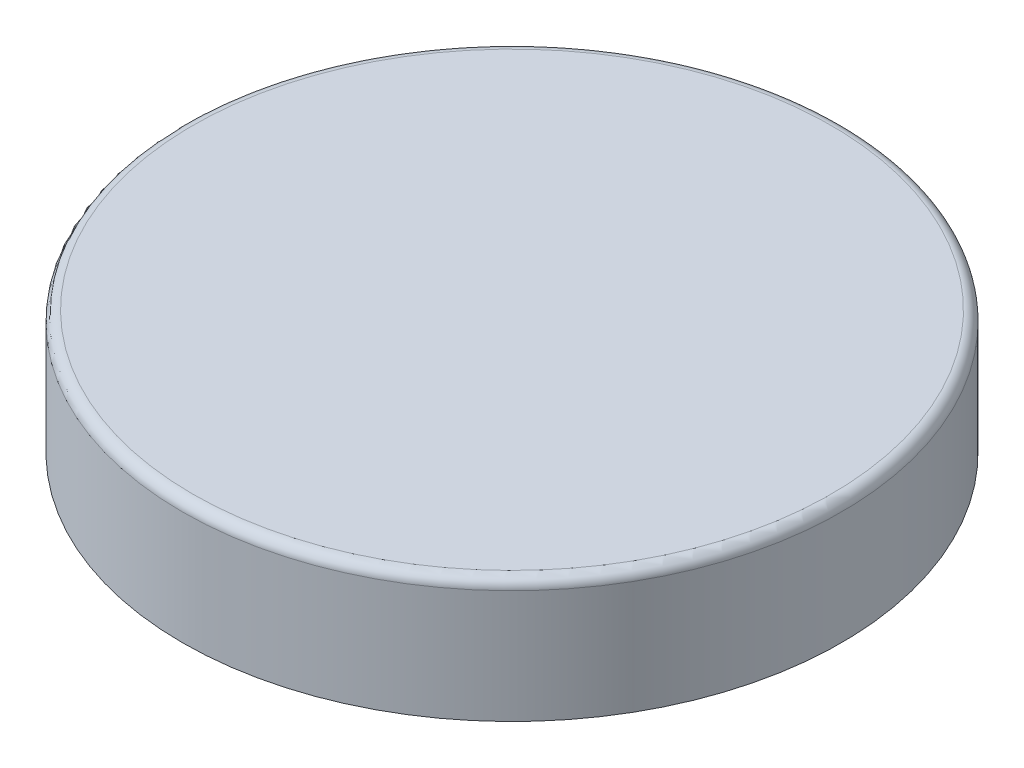
ISO-10303-21;
HEADER;
FILE_DESCRIPTION(('STEP AP214'),'2;1');
FILE_NAME('part.step','',(''),(''),'','','');
FILE_SCHEMA(('AUTOMOTIVE_DESIGN { 1 0 10303 214 1 1 1 1 }'));
ENDSEC;
DATA;
#1=APPLICATION_CONTEXT('core data for automotive mechanical design processes');
#2=APPLICATION_PROTOCOL_DEFINITION('international standard','automotive_design',2000,#1);
#3=PRODUCT_CONTEXT('',#1,'mechanical');
#4=PRODUCT('Part','Part','',(#3));
#5=PRODUCT_RELATED_PRODUCT_CATEGORY('part','',(#4));
#6=PRODUCT_DEFINITION_FORMATION('','',#4);
#7=PRODUCT_DEFINITION_CONTEXT('part definition',#1,'design');
#8=PRODUCT_DEFINITION('design','',#6,#7);
#9=PRODUCT_DEFINITION_SHAPE('','',#8);
#10=(LENGTH_UNIT() NAMED_UNIT(*) SI_UNIT(.MILLI.,.METRE.));
#11=(NAMED_UNIT(*) PLANE_ANGLE_UNIT() SI_UNIT($,.RADIAN.));
#12=(NAMED_UNIT(*) SI_UNIT($,.STERADIAN.) SOLID_ANGLE_UNIT());
#13=UNCERTAINTY_MEASURE_WITH_UNIT(LENGTH_MEASURE(1.E-05),#10,'distance_accuracy_value','');
#14=(GEOMETRIC_REPRESENTATION_CONTEXT(3) GLOBAL_UNCERTAINTY_ASSIGNED_CONTEXT((#13)) GLOBAL_UNIT_ASSIGNED_CONTEXT((#10,
#11,#12)) REPRESENTATION_CONTEXT('',''));
#15=CARTESIAN_POINT('',(0.,0.,0.));
#16=DIRECTION('',(0.,0.,1.));
#17=DIRECTION('',(1.,0.,0.));
#18=AXIS2_PLACEMENT_3D('',#15,#16,#17);
#19=CARTESIAN_POINT('',(0.,4.7625,0.));
#20=DIRECTION('',(0.,1.,0.));
#21=DIRECTION('',(0.,0.,1.));
#22=AXIS2_PLACEMENT_3D('',#19,#20,#21);
#23=PLANE('',#22);
#24=CARTESIAN_POINT('',(0.,4.7625,0.));
#25=DIRECTION('',(0.,1.,0.));
#26=DIRECTION('',(0.,0.,1.));
#27=AXIS2_PLACEMENT_3D('',#24,#25,#26);
#28=CIRCLE('',#27,24.60625);
#29=CARTESIAN_POINT('',(0.,4.7625,24.60625));
#30=VERTEX_POINT('',#29);
#31=EDGE_CURVE('E53',#30,#30,#28,.T.);
#32=ORIENTED_EDGE('',*,*,#31,.T.);
#33=EDGE_LOOP('',(#32));
#34=FACE_BOUND('',#33,.T.);
#35=ADVANCED_FACE('F33',(#34),#23,.T.);
#36=CARTESIAN_POINT('',(0.,-32.3252119356495,0.));
#37=DIRECTION('',(0.,-1.,0.));
#38=DIRECTION('',(0.,0.,-1.));
#39=AXIS2_PLACEMENT_3D('',#36,#37,#38);
#40=CYLINDRICAL_SURFACE('',#39,25.4);
#41=CARTESIAN_POINT('',(0.,3.96875,0.));
#42=DIRECTION('',(0.,1.,0.));
#43=DIRECTION('',(0.,0.,1.));
#44=AXIS2_PLACEMENT_3D('',#41,#42,#43);
#45=CIRCLE('',#44,25.4);
#46=CARTESIAN_POINT('',(0.,3.96875,25.4));
#47=VERTEX_POINT('',#46);
#48=EDGE_CURVE('E56',#47,#47,#45,.F.);
#49=ORIENTED_EDGE('',*,*,#48,.T.);
#50=EDGE_LOOP('',(#49));
#51=FACE_BOUND('',#50,.T.);
#52=CARTESIAN_POINT('',(0.,-4.7625,0.));
#53=DIRECTION('',(0.,-1.,0.));
#54=DIRECTION('',(0.,0.,-1.));
#55=AXIS2_PLACEMENT_3D('',#52,#53,#54);
#56=CIRCLE('',#55,25.4);
#57=CARTESIAN_POINT('',(0.,-4.7625,-25.4));
#58=VERTEX_POINT('',#57);
#59=EDGE_CURVE('E59',#58,#58,#56,.T.);
#60=ORIENTED_EDGE('',*,*,#59,.F.);
#61=EDGE_LOOP('',(#60));
#62=FACE_BOUND('',#61,.T.);
#63=ADVANCED_FACE('F65',(#51,#62),#40,.T.);
#64=CARTESIAN_POINT('',(0.,-4.7625,-25.4));
#65=DIRECTION('',(0.,-1.,0.));
#66=DIRECTION('',(0.,0.,-1.));
#67=AXIS2_PLACEMENT_3D('',#64,#65,#66);
#68=PLANE('',#67);
#69=CARTESIAN_POINT('',(0.,-4.7625,0.));
#70=DIRECTION('',(0.,-1.,0.));
#71=DIRECTION('',(0.,0.,-1.));
#72=AXIS2_PLACEMENT_3D('',#69,#70,#71);
#73=CIRCLE('',#72,23.01875);
#74=CARTESIAN_POINT('',(0.,-4.7625,-23.01875));
#75=VERTEX_POINT('',#74);
#76=EDGE_CURVE('E10',#75,#75,#73,.F.);
#77=ORIENTED_EDGE('',*,*,#76,.T.);
#78=EDGE_LOOP('',(#77));
#79=FACE_BOUND('',#78,.T.);
#80=ORIENTED_EDGE('',*,*,#59,.T.);
#81=EDGE_LOOP('',(#80));
#82=FACE_BOUND('',#81,.T.);
#83=ADVANCED_FACE('F63',(#79,#82),#68,.T.);
#84=CARTESIAN_POINT('',(0.,-32.3252119356495,0.));
#85=DIRECTION('',(0.,-1.,0.));
#86=DIRECTION('',(0.,0.,-1.));
#87=AXIS2_PLACEMENT_3D('',#84,#85,#86);
#88=CYLINDRICAL_SURFACE('',#87,22.225);
#89=CARTESIAN_POINT('',(0.,0.793750000000003,0.));
#90=DIRECTION('',(0.,-1.,0.));
#91=DIRECTION('',(0.,0.,-1.));
#92=AXIS2_PLACEMENT_3D('',#89,#90,#91);
#93=CIRCLE('',#92,22.225);
#94=CARTESIAN_POINT('',(0.,0.793750000000003,-22.225));
#95=VERTEX_POINT('',#94);
#96=EDGE_CURVE('E40',#95,#95,#93,.F.);
#97=ORIENTED_EDGE('',*,*,#96,.T.);
#98=EDGE_LOOP('',(#97));
#99=FACE_BOUND('',#98,.T.);
#100=CARTESIAN_POINT('',(0.,-3.96875,0.));
#101=DIRECTION('',(0.,-1.,0.));
#102=DIRECTION('',(0.,0.,-1.));
#103=AXIS2_PLACEMENT_3D('',#100,#101,#102);
#104=CIRCLE('',#103,22.225);
#105=CARTESIAN_POINT('',(0.,-3.96875,-22.225));
#106=VERTEX_POINT('',#105);
#107=EDGE_CURVE('E44',#106,#106,#104,.T.);
#108=ORIENTED_EDGE('',*,*,#107,.T.);
#109=EDGE_LOOP('',(#108));
#110=FACE_BOUND('',#109,.T.);
#111=ADVANCED_FACE('F73',(#99,#110),#88,.F.);
#112=CARTESIAN_POINT('',(0.,1.5875,-22.225));
#113=DIRECTION('',(0.,-1.,0.));
#114=DIRECTION('',(0.,0.,-1.));
#115=AXIS2_PLACEMENT_3D('',#112,#113,#114);
#116=PLANE('',#115);
#117=CARTESIAN_POINT('',(0.,1.5875,0.));
#118=DIRECTION('',(0.,-1.,0.));
#119=DIRECTION('',(0.,0.,-1.));
#120=AXIS2_PLACEMENT_3D('',#117,#118,#119);
#121=CIRCLE('',#120,21.43125);
#122=CARTESIAN_POINT('',(0.,1.5875,-21.43125));
#123=VERTEX_POINT('',#122);
#124=EDGE_CURVE('E48',#123,#123,#121,.T.);
#125=ORIENTED_EDGE('',*,*,#124,.T.);
#126=EDGE_LOOP('',(#125));
#127=FACE_BOUND('',#126,.T.);
#128=ADVANCED_FACE('F82',(#127),#116,.T.);
#129=CARTESIAN_POINT('',(0.,3.96875,0.));
#130=DIRECTION('',(0.,1.,0.));
#131=DIRECTION('',(0.,0.,1.));
#132=AXIS2_PLACEMENT_3D('',#129,#130,#131);
#133=TOROIDAL_SURFACE('',#132,24.60625,0.79375);
#134=ORIENTED_EDGE('',*,*,#31,.F.);
#135=EDGE_LOOP('',(#134));
#136=FACE_BOUND('',#135,.T.);
#137=ORIENTED_EDGE('',*,*,#48,.F.);
#138=EDGE_LOOP('',(#137));
#139=FACE_BOUND('',#138,.T.);
#140=ADVANCED_FACE('F79',(#136,#139),#133,.T.);
#141=CARTESIAN_POINT('',(0.,0.793750000000003,0.));
#142=DIRECTION('',(0.,-1.,0.));
#143=DIRECTION('',(0.,0.,-1.));
#144=AXIS2_PLACEMENT_3D('',#141,#142,#143);
#145=TOROIDAL_SURFACE('',#144,21.43125,0.79375);
#146=ORIENTED_EDGE('',*,*,#96,.F.);
#147=EDGE_LOOP('',(#146));
#148=FACE_BOUND('',#147,.T.);
#149=ORIENTED_EDGE('',*,*,#124,.F.);
#150=EDGE_LOOP('',(#149));
#151=FACE_BOUND('',#150,.T.);
#152=ADVANCED_FACE('F81',(#148,#151),#145,.F.);
#153=CARTESIAN_POINT('',(0.,-3.96875,0.));
#154=DIRECTION('',(0.,-1.,0.));
#155=DIRECTION('',(0.,0.,-1.));
#156=AXIS2_PLACEMENT_3D('',#153,#154,#155);
#157=TOROIDAL_SURFACE('',#156,23.01875,0.79375);
#158=ORIENTED_EDGE('',*,*,#76,.F.);
#159=EDGE_LOOP('',(#158));
#160=FACE_BOUND('',#159,.T.);
#161=ORIENTED_EDGE('',*,*,#107,.F.);
#162=EDGE_LOOP('',(#161));
#163=FACE_BOUND('',#162,.T.);
#164=ADVANCED_FACE('F35',(#160,#163),#157,.T.);
#165=CLOSED_SHELL('',(#35,#63,#83,#111,#128,#140,#152,#164));
#166=MANIFOLD_SOLID_BREP('B2',#165);
#167=ADVANCED_BREP_SHAPE_REPRESENTATION('',(#18,#166),#14);
#168=SHAPE_DEFINITION_REPRESENTATION(#9,#167);
ENDSEC;
END-ISO-10303-21;
